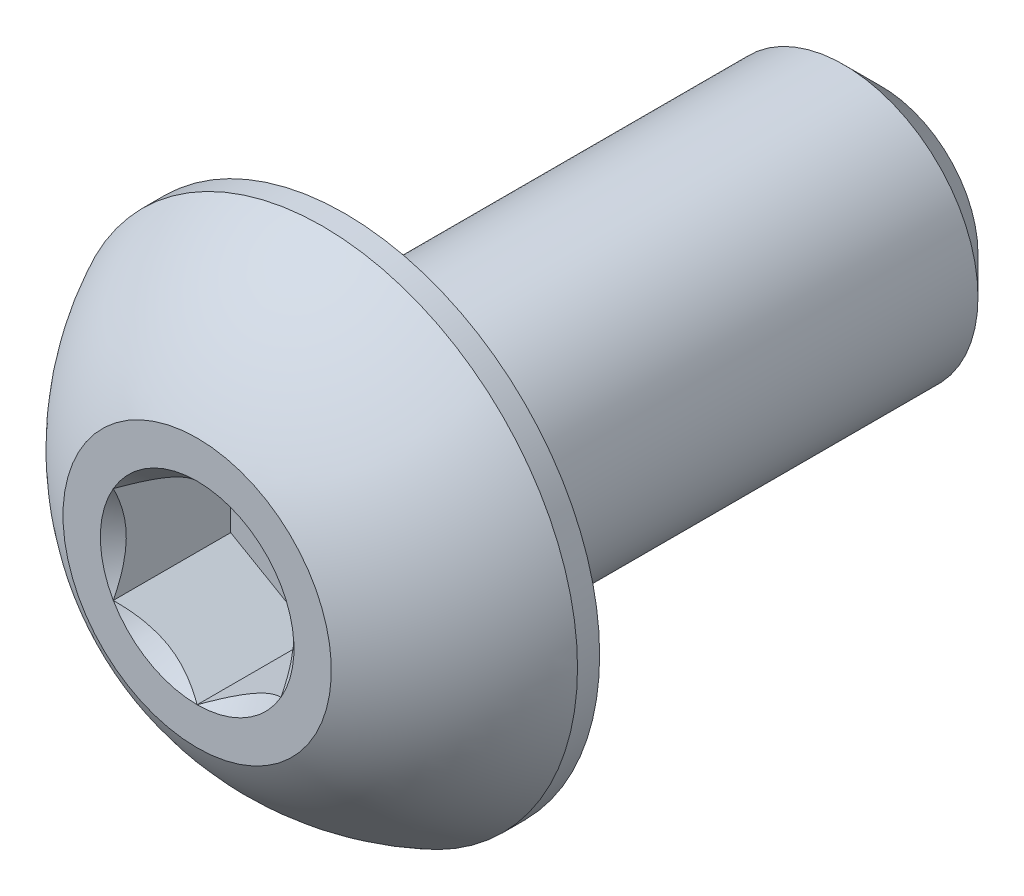
ISO-10303-21;
HEADER;
FILE_DESCRIPTION(('STEP AP214'),'2;1');
FILE_NAME('part.step','',(''),(''),'','','');
FILE_SCHEMA(('AUTOMOTIVE_DESIGN { 1 0 10303 214 1 1 1 1 }'));
ENDSEC;
DATA;
#1=APPLICATION_CONTEXT('core data for automotive mechanical design processes');
#2=APPLICATION_PROTOCOL_DEFINITION('international standard','automotive_design',2000,#1);
#3=PRODUCT_CONTEXT('',#1,'mechanical');
#4=PRODUCT('Part','Part','',(#3));
#5=PRODUCT_RELATED_PRODUCT_CATEGORY('part','',(#4));
#6=PRODUCT_DEFINITION_FORMATION('','',#4);
#7=PRODUCT_DEFINITION_CONTEXT('part definition',#1,'design');
#8=PRODUCT_DEFINITION('design','',#6,#7);
#9=PRODUCT_DEFINITION_SHAPE('','',#8);
#10=(LENGTH_UNIT() NAMED_UNIT(*) SI_UNIT(.MILLI.,.METRE.));
#11=(NAMED_UNIT(*) PLANE_ANGLE_UNIT() SI_UNIT($,.RADIAN.));
#12=(NAMED_UNIT(*) SI_UNIT($,.STERADIAN.) SOLID_ANGLE_UNIT());
#13=UNCERTAINTY_MEASURE_WITH_UNIT(LENGTH_MEASURE(1.E-05),#10,'distance_accuracy_value','');
#14=(GEOMETRIC_REPRESENTATION_CONTEXT(3) GLOBAL_UNCERTAINTY_ASSIGNED_CONTEXT((#13)) GLOBAL_UNIT_ASSIGNED_CONTEXT((#10,
#11,#12)) REPRESENTATION_CONTEXT('',''));
#15=CARTESIAN_POINT('',(0.,0.,0.));
#16=DIRECTION('',(0.,0.,1.));
#17=DIRECTION('',(1.,0.,0.));
#18=AXIS2_PLACEMENT_3D('',#15,#16,#17);
#19=CARTESIAN_POINT('',(0.,0.,5.1));
#20=DIRECTION('',(0.,0.,-1.));
#21=DIRECTION('',(-1.,0.,0.));
#22=AXIS2_PLACEMENT_3D('',#19,#20,#21);
#23=PLANE('',#22);
#24=CARTESIAN_POINT('',(0.,0.,5.1));
#25=DIRECTION('',(0.,0.,1.));
#26=DIRECTION('',(1.,0.,0.));
#27=AXIS2_PLACEMENT_3D('',#24,#25,#26);
#28=CIRCLE('',#27,1.44337567297406);
#29=CARTESIAN_POINT('',(-1.25,0.721687836487033,5.1));
#30=VERTEX_POINT('',#29);
#31=CARTESIAN_POINT('',(-1.25,-0.721687836487033,5.1));
#32=VERTEX_POINT('',#31);
#33=EDGE_CURVE('E132',#30,#32,#28,.T.);
#34=ORIENTED_EDGE('',*,*,#33,.F.);
#35=CARTESIAN_POINT('',(0.,1.44337567297406,5.1));
#36=VERTEX_POINT('',#35);
#37=EDGE_CURVE('E104',#36,#30,#28,.T.);
#38=ORIENTED_EDGE('',*,*,#37,.F.);
#39=CARTESIAN_POINT('',(1.25,0.721687836487032,5.1));
#40=VERTEX_POINT('',#39);
#41=EDGE_CURVE('E95',#40,#36,#28,.T.);
#42=ORIENTED_EDGE('',*,*,#41,.F.);
#43=CARTESIAN_POINT('',(1.25,-0.721687836487032,5.1));
#44=VERTEX_POINT('',#43);
#45=EDGE_CURVE('E56',#44,#40,#28,.T.);
#46=ORIENTED_EDGE('',*,*,#45,.F.);
#47=CARTESIAN_POINT('',(0.,-1.44337567297406,5.1));
#48=VERTEX_POINT('',#47);
#49=EDGE_CURVE('E63',#48,#44,#28,.T.);
#50=ORIENTED_EDGE('',*,*,#49,.F.);
#51=EDGE_CURVE('E133',#32,#48,#28,.T.);
#52=ORIENTED_EDGE('',*,*,#51,.F.);
#53=EDGE_LOOP('',(#34,#38,#42,#46,#50,#52));
#54=FACE_BOUND('',#53,.T.);
#55=CARTESIAN_POINT('',(0.,0.,5.1));
#56=DIRECTION('',(0.,0.,1.));
#57=DIRECTION('',(1.,0.,0.));
#58=AXIS2_PLACEMENT_3D('',#55,#56,#57);
#59=CIRCLE('',#58,2.);
#60=CARTESIAN_POINT('',(0.,2.,5.1));
#61=VERTEX_POINT('',#60);
#62=EDGE_CURVE('E50',#61,#61,#59,.T.);
#63=ORIENTED_EDGE('',*,*,#62,.T.);
#64=EDGE_LOOP('',(#63));
#65=FACE_BOUND('',#64,.T.);
#66=ADVANCED_FACE('F37',(#54,#65),#23,.F.);
#67=CARTESIAN_POINT('',(0.,0.,1.37355614973262));
#68=DIRECTION('',(0.,0.,1.));
#69=DIRECTION('',(0.,1.,0.));
#70=AXIS2_PLACEMENT_3D('',#67,#68,#69);
#71=SPHERICAL_SURFACE('',#70,4.22922968981298);
#72=CARTESIAN_POINT('',(0.,0.,3.23));
#73=DIRECTION('',(0.,0.,1.));
#74=DIRECTION('',(1.,0.,0.));
#75=AXIS2_PLACEMENT_3D('',#72,#73,#74);
#76=CIRCLE('',#75,3.8);
#77=CARTESIAN_POINT('',(0.,3.8,3.23));
#78=VERTEX_POINT('',#77);
#79=EDGE_CURVE('E215',#78,#78,#76,.T.);
#80=CARTESIAN_POINT('',(0.,2.,5.1));
#81=CARTESIAN_POINT('',(0.,2.02421343985614,5.08700457403551));
#82=CARTESIAN_POINT('',(0.,2.04830018323974,5.07377308703487));
#83=CARTESIAN_POINT('',(0.,2.09621120342126,5.04684315849425));
#84=CARTESIAN_POINT('',(0.,2.12003548021917,5.03314471695427));
#85=CARTESIAN_POINT('',(0.,2.16741249358867,5.00528604686797));
#86=CARTESIAN_POINT('',(0.,2.19096523016026,4.99112581832164));
#87=CARTESIAN_POINT('',(0.,2.23779021933682,4.96234896476404));
#88=CARTESIAN_POINT('',(0.,2.2610624719418,4.94773233975278));
#89=CARTESIAN_POINT('',(0.,2.30731764886072,4.91804824448586));
#90=CARTESIAN_POINT('',(0.,2.33030057317465,4.9029807742302));
#91=CARTESIAN_POINT('',(0.,2.37596836104235,4.87240071441713));
#92=CARTESIAN_POINT('',(0.,2.39865322459612,4.85688812485971));
#93=CARTESIAN_POINT('',(0.,2.44371627121513,4.82542372060412));
#94=CARTESIAN_POINT('',(0.,2.46609445428038,4.80947190590595));
#95=CARTESIAN_POINT('',(0.,2.51053563686181,4.77713511266833));
#96=CARTESIAN_POINT('',(0.,2.532598636378,4.76075013412888));
#97=CARTESIAN_POINT('',(0.,2.57640106852492,4.72755323903277));
#98=CARTESIAN_POINT('',(0.,2.59814050115564,4.71074132247611));
#99=CARTESIAN_POINT('',(0.,2.64128753915153,4.67669693941185));
#100=CARTESIAN_POINT('',(0.,2.66269514451671,4.65946447290426));
#101=CARTESIAN_POINT('',(0.,2.70517039368395,4.62458553779703));
#102=CARTESIAN_POINT('',(0.,2.72623803748602,4.6069390691974));
#103=CARTESIAN_POINT('',(0.,2.76802535840618,4.57123883507559));
#104=CARTESIAN_POINT('',(0.,2.78874503552428,4.55318506955341));
#105=CARTESIAN_POINT('',(0.,2.82982855017313,4.51667710151719));
#106=CARTESIAN_POINT('',(0.,2.85019238770389,4.49822289900316));
#107=CARTESIAN_POINT('',(0.,2.89055648548394,4.46092106906898));
#108=CARTESIAN_POINT('',(0.,2.91055674573324,4.44207344164884));
#109=CARTESIAN_POINT('',(0.,2.95018608940553,4.40399192347873));
#110=CARTESIAN_POINT('',(0.,2.96981517282852,4.38475803272878));
#111=CARTESIAN_POINT('',(0.,3.00869470434027,4.34591129624471));
#112=CARTESIAN_POINT('',(0.,3.02794515242903,4.3262984505106));
#113=CARTESIAN_POINT('',(0.,3.06606009863533,4.28670125639628));
#114=CARTESIAN_POINT('',(0.,3.08492459675287,4.26671690801607));
#115=CARTESIAN_POINT('',(0.,3.12226047503002,4.22638430210832));
#116=CARTESIAN_POINT('',(0.,3.14073185518965,4.20603604458079));
#117=CARTESIAN_POINT('',(0.,3.17727447893821,4.16498335215256));
#118=CARTESIAN_POINT('',(0.,3.19534572252715,4.14427891725186));
#119=CARTESIAN_POINT('',(0.,3.23108120656242,4.10252173718901));
#120=CARTESIAN_POINT('',(0.,3.24874544700875,4.08146899202686));
#121=CARTESIAN_POINT('',(0.,3.28366021283673,4.03902319090103));
#122=CARTESIAN_POINT('',(0.,3.30091073821838,4.01763013493736));
#123=CARTESIAN_POINT('',(0.,3.33499151919534,3.97451184097717));
#124=CARTESIAN_POINT('',(0.,3.35182177479064,3.95278660298064));
#125=CARTESIAN_POINT('',(0.,3.38505562116371,3.9090121999432));
#126=CARTESIAN_POINT('',(0.,3.40145921194149,3.88696303490229));
#127=CARTESIAN_POINT('',(0.,3.43383349577047,3.84254915584848));
#128=CARTESIAN_POINT('',(0.,3.44980418882166,3.8201844418356));
#129=CARTESIAN_POINT('',(0.,3.48130660877275,3.77514796280767));
#130=CARTESIAN_POINT('',(0.,3.49683833567264,3.75247619779264));
#131=CARTESIAN_POINT('',(0.,3.52745692170931,3.70683423141033));
#132=CARTESIAN_POINT('',(0.,3.5425437808461,3.68386403004306));
#133=CARTESIAN_POINT('',(0.,3.57226689871518,3.63763391896935));
#134=CARTESIAN_POINT('',(0.,3.58690315744748,3.61437400926291));
#135=CARTESIAN_POINT('',(0.,3.61571951333199,3.56757331973341));
#136=CARTESIAN_POINT('',(0.,3.62989961048422,3.54403253991033));
#137=CARTESIAN_POINT('',(0.,3.65779825442823,3.4966790546141));
#138=CARTESIAN_POINT('',(0.,3.67151680122002,3.47286634914094));
#139=CARTESIAN_POINT('',(0.,3.69848713452321,3.42497806212234));
#140=CARTESIAN_POINT('',(0.,3.71173892103461,3.4009024805769));
#141=CARTESIAN_POINT('',(0.,3.73777068821038,3.35249758420785));
#142=CARTESIAN_POINT('',(0.,3.75055066887474,3.32816826938425));
#143=CARTESIAN_POINT('',(0.,3.77563400658953,3.27926517055481));
#144=CARTESIAN_POINT('',(0.,3.78793736363997,3.25469138654897));
#145=CARTESIAN_POINT('',(0.,3.8,3.23));
#146=B_SPLINE_CURVE_WITH_KNOTS('',3,(#80,#81,#82,#83,#84,#85,#86,#87,#88,#89,#90,#91,#92,#93,
#94,#95,#96,#97,#98,#99,#100,#101,#102,#103,#104,#105,#106,#107,#108,#109,#110,#111,#112,#113,
#114,#115,#116,#117,#118,#119,#120,#121,#122,#123,#124,#125,#126,#127,#128,#129,#130,#131,#132,
#133,#134,#135,#136,#137,#138,#139,#140,#141,#142,#143,#144,#145),.UNSPECIFIED.,.F.,.F.,(4,2,2,
2,2,2,2,2,2,2,2,2,2,2,2,2,2,2,2,2,2,2,2,2,2,2,2,2,2,2,2,2,4),(0.,0.0824398589102646,
0.164879717820529,0.247319576730793,0.329759435641058,0.412199294551322,0.494639153461587,
0.57707901237185,0.659518871282115,0.741958730192379,0.824398589102644,0.906838448012908,
0.989278306923172,1.07171816583344,1.1541580247437,1.23659788365396,1.31903774256423,
1.40147760147449,1.48391746038476,1.56635731929502,1.64879717820529,1.73123703711555,
1.81367689602582,1.89611675493608,1.97855661384634,2.06099647275661,2.14343633166687,
2.22587619057714,2.3083160494874,2.39075590839767,2.47319576730793,2.55563562621819,
2.63807548512846),.UNSPECIFIED.);
#147=EDGE_CURVE('BSEAM220',#61,#78,#146,.T.);
#148=ORIENTED_EDGE('',*,*,#62,.F.);
#149=ORIENTED_EDGE('',*,*,#79,.T.);
#150=ORIENTED_EDGE('',*,*,#147,.T.);
#151=ORIENTED_EDGE('',*,*,#147,.F.);
#152=EDGE_LOOP('',(#148,#150,#149,#151));
#153=FACE_BOUND('',#152,.T.);
#154=ADVANCED_FACE('F220',(#153),#71,.T.);
#155=CARTESIAN_POINT('',(0.,0.,5.1));
#156=DIRECTION('',(0.,0.,1.));
#157=DIRECTION('',(1.,0.,0.));
#158=AXIS2_PLACEMENT_3D('',#155,#156,#157);
#159=CYLINDRICAL_SURFACE('',#158,3.8);
#160=ORIENTED_EDGE('',*,*,#79,.F.);
#161=EDGE_LOOP('',(#160));
#162=FACE_BOUND('',#161,.T.);
#163=CARTESIAN_POINT('',(0.,0.,2.9));
#164=DIRECTION('',(0.,0.,1.));
#165=DIRECTION('',(1.,0.,0.));
#166=AXIS2_PLACEMENT_3D('',#163,#164,#165);
#167=CIRCLE('',#166,3.8);
#168=CARTESIAN_POINT('',(3.8,0.,2.9));
#169=VERTEX_POINT('',#168);
#170=EDGE_CURVE('E212',#169,#169,#167,.T.);
#171=ORIENTED_EDGE('',*,*,#170,.T.);
#172=EDGE_LOOP('',(#171));
#173=FACE_BOUND('',#172,.T.);
#174=ADVANCED_FACE('F223',(#162,#173),#159,.T.);
#175=CARTESIAN_POINT('',(0.,2.,2.9));
#176=DIRECTION('',(0.,0.,1.));
#177=DIRECTION('',(1.,0.,0.));
#178=AXIS2_PLACEMENT_3D('',#175,#176,#177);
#179=PLANE('',#178);
#180=ORIENTED_EDGE('',*,*,#170,.F.);
#181=EDGE_LOOP('',(#180));
#182=FACE_BOUND('',#181,.T.);
#183=CARTESIAN_POINT('',(0.,0.,2.9));
#184=DIRECTION('',(0.,0.,1.));
#185=DIRECTION('',(1.,0.,0.));
#186=AXIS2_PLACEMENT_3D('',#183,#184,#185);
#187=CIRCLE('',#186,2.);
#188=CARTESIAN_POINT('',(2.,0.,2.9));
#189=VERTEX_POINT('',#188);
#190=EDGE_CURVE('E209',#189,#189,#187,.T.);
#191=ORIENTED_EDGE('',*,*,#190,.T.);
#192=EDGE_LOOP('',(#191));
#193=FACE_BOUND('',#192,.T.);
#194=ADVANCED_FACE('F228',(#182,#193),#179,.F.);
#195=CARTESIAN_POINT('',(0.,0.,5.1));
#196=DIRECTION('',(0.,0.,1.));
#197=DIRECTION('',(1.,0.,0.));
#198=AXIS2_PLACEMENT_3D('',#195,#196,#197);
#199=CYLINDRICAL_SURFACE('',#198,2.);
#200=ORIENTED_EDGE('',*,*,#190,.F.);
#201=EDGE_LOOP('',(#200));
#202=FACE_BOUND('',#201,.T.);
#203=CARTESIAN_POINT('',(0.,0.,-4.54));
#204=DIRECTION('',(0.,0.,1.));
#205=DIRECTION('',(1.,0.,0.));
#206=AXIS2_PLACEMENT_3D('',#203,#204,#205);
#207=CIRCLE('',#206,2.);
#208=CARTESIAN_POINT('',(2.,0.,-4.54));
#209=VERTEX_POINT('',#208);
#210=EDGE_CURVE('E206',#209,#209,#207,.T.);
#211=ORIENTED_EDGE('',*,*,#210,.T.);
#212=EDGE_LOOP('',(#211));
#213=FACE_BOUND('',#212,.T.);
#214=ADVANCED_FACE('F234',(#202,#213),#199,.T.);
#215=CARTESIAN_POINT('',(0.,0.,-5.1));
#216=DIRECTION('',(0.,0.,1.));
#217=DIRECTION('',(1.,0.,0.));
#218=AXIS2_PLACEMENT_3D('',#215,#216,#217);
#219=CONICAL_SURFACE('',#218,1.44,0.785398163397445);
#220=ORIENTED_EDGE('',*,*,#210,.F.);
#221=EDGE_LOOP('',(#220));
#222=FACE_BOUND('',#221,.T.);
#223=CARTESIAN_POINT('',(0.,0.,-5.1));
#224=DIRECTION('',(0.,0.,1.));
#225=DIRECTION('',(1.,0.,0.));
#226=AXIS2_PLACEMENT_3D('',#223,#224,#225);
#227=CIRCLE('',#226,1.44);
#228=CARTESIAN_POINT('',(1.44,0.,-5.1));
#229=VERTEX_POINT('',#228);
#230=EDGE_CURVE('E193',#229,#229,#227,.T.);
#231=ORIENTED_EDGE('',*,*,#230,.T.);
#232=EDGE_LOOP('',(#231));
#233=FACE_BOUND('',#232,.T.);
#234=ADVANCED_FACE('F240',(#222,#233),#219,.T.);
#235=CARTESIAN_POINT('',(0.,0.,-5.1));
#236=DIRECTION('',(0.,0.,1.));
#237=DIRECTION('',(1.,0.,0.));
#238=AXIS2_PLACEMENT_3D('',#235,#236,#237);
#239=PLANE('',#238);
#240=ORIENTED_EDGE('',*,*,#230,.F.);
#241=EDGE_LOOP('',(#240));
#242=FACE_BOUND('',#241,.T.);
#243=ADVANCED_FACE('F166',(#242),#239,.F.);
#244=CARTESIAN_POINT('',(0.,0.,5.1));
#245=DIRECTION('',(0.,0.,1.));
#246=DIRECTION('',(1.,0.,0.));
#247=AXIS2_PLACEMENT_3D('',#244,#245,#246);
#248=CONICAL_SURFACE('',#247,1.44337567297406,0.78539816339745);
#249=ORIENTED_EDGE('',*,*,#37,.T.);
#250=CARTESIAN_POINT('',(0.000199999999999987,1.4434911430279,5.10011548390914));
#251=CARTESIAN_POINT('',(-0.0427751670715869,1.41867941875065,5.0753216680551));
#252=CARTESIAN_POINT('',(-0.0864690047459484,1.39345276980743,5.05198373441868));
#253=CARTESIAN_POINT('',(-0.175565930841942,1.34201263554194,5.00925200408454));
#254=CARTESIAN_POINT('',(-0.220977498357064,1.31579425481276,4.98988199236041));
#255=CARTESIAN_POINT('',(-0.31254782093526,1.26292610442246,4.95670048341348));
#256=CARTESIAN_POINT('',(-0.358683240175886,1.23628980770471,4.94280555905266));
#257=CARTESIAN_POINT('',(-0.451970080407593,1.18243062538508,4.92139728216064));
#258=CARTESIAN_POINT('',(-0.49911864913638,1.15520938653761,4.91386794156679));
#259=CARTESIAN_POINT('',(-0.580373556887253,1.10829684367467,4.9070744980507));
#260=CARTESIAN_POINT('',(-0.614374876627941,1.08866617256958,4.90606855910435));
#261=CARTESIAN_POINT('',(-0.682317764432478,1.04943932800611,4.90776141491132));
#262=CARTESIAN_POINT('',(-0.716259317655658,1.02984316311599,4.91046102721554));
#263=CARTESIAN_POINT('',(-0.7838148564575,0.990839954603499,4.91940893031638));
#264=CARTESIAN_POINT('',(-0.817428507286775,0.971433104248771,4.92566052589971));
#265=CARTESIAN_POINT('',(-0.884094638217813,0.932943395609905,4.9413756814139));
#266=CARTESIAN_POINT('',(-0.917146871030296,0.913860680098301,4.95084062008746));
#267=CARTESIAN_POINT('',(-1.00179969160026,0.864986351354568,4.97893139068759));
#268=CARTESIAN_POINT('',(-1.05286649242964,0.835502920149076,4.9996701574522));
#269=CARTESIAN_POINT('',(-1.15300085411325,0.777690319475909,5.04638713467148));
#270=CARTESIAN_POINT('',(-1.20207431157827,0.749357745598417,5.07234829594677));
#271=CARTESIAN_POINT('',(-1.2502,0.721572366433195,5.10011548390914));
#272=B_SPLINE_CURVE_WITH_KNOTS('',3,(#250,#251,#252,#253,#254,#255,#256,#257,#258,#259,#260,
#261,#262,#263,#264,#265,#266,#267,#268,#269,#270,#271),.UNSPECIFIED.,.F.,.F.,(4,2,2,2,2,2,2,2,
2,2,4),(0.,0.166533409618304,0.334037607289762,0.498880396489699,0.663307919240275,
0.780963963458827,0.898645970148453,1.01643764860773,1.1342799317155,1.32148652032141,
1.50809158792573),.UNSPECIFIED.);
#273=EDGE_CURVE('E11',#36,#30,#272,.T.);
#274=ORIENTED_EDGE('',*,*,#273,.F.);
#275=EDGE_LOOP('',(#249,#274));
#276=FACE_BOUND('',#275,.T.);
#277=ADVANCED_FACE('F108',(#276),#248,.F.);
#278=ORIENTED_EDGE('',*,*,#33,.T.);
#279=CARTESIAN_POINT('',(-1.25,-1.43934010808077,5.56298209689233));
#280=CARTESIAN_POINT('',(-1.25,-1.40429313005659,5.53652492263289));
#281=CARTESIAN_POINT('',(-1.25,-1.36905087135599,5.51032716035428));
#282=CARTESIAN_POINT('',(-1.25,-1.29809650706311,5.45855757183958));
#283=CARTESIAN_POINT('',(-1.25,-1.26238428576495,5.43298590435629));
#284=CARTESIAN_POINT('',(-1.25,-1.15390111792708,5.35700599368946));
#285=CARTESIAN_POINT('',(-1.25,-1.08031646726264,5.30774028618957));
#286=CARTESIAN_POINT('',(-1.25,-0.926012322755095,5.21102583026313));
#287=CARTESIAN_POINT('',(-1.25,-0.845125318656146,5.1638412989418));
#288=CARTESIAN_POINT('',(-1.25,-0.679311174076602,5.07753073439041));
#289=CARTESIAN_POINT('',(-1.25,-0.594398891026687,5.0383775346269));
#290=CARTESIAN_POINT('',(-1.25,-0.46694481246074,4.99047722368829));
#291=CARTESIAN_POINT('',(-1.25,-0.426289985812821,4.97672948978634));
#292=CARTESIAN_POINT('',(-1.25,-0.343998850091267,4.95249792745054));
#293=CARTESIAN_POINT('',(-1.25,-0.302362473614962,4.94201432386977));
#294=CARTESIAN_POINT('',(-1.25,-0.219052696285665,4.9250301617483));
#295=CARTESIAN_POINT('',(-1.25,-0.1773934284745,4.91846136047137));
#296=CARTESIAN_POINT('',(-1.25,-0.0936293693401921,4.90943505345776));
#297=CARTESIAN_POINT('',(-1.25,-0.0515246558543961,4.90697684099727));
#298=CARTESIAN_POINT('',(-1.25,0.0311890576306314,4.90635406201329));
#299=CARTESIAN_POINT('',(-1.25,0.0717969625499302,4.90803711684625));
#300=CARTESIAN_POINT('',(-1.25,0.152668636885197,4.91526827059791));
#301=CARTESIAN_POINT('',(-1.25,0.192932338835358,4.92081711041311));
#302=CARTESIAN_POINT('',(-1.25,0.273499879165295,4.93557103646495));
#303=CARTESIAN_POINT('',(-1.25,0.313792180618511,4.94483817596411));
#304=CARTESIAN_POINT('',(-1.25,0.393496413911457,4.96653617845735));
#305=CARTESIAN_POINT('',(-1.25,0.432908419115059,4.97896677673064));
#306=CARTESIAN_POINT('',(-1.25,0.556992735862298,5.02277935293144));
#307=CARTESIAN_POINT('',(-1.25,0.639898924666085,5.05915107287596));
#308=CARTESIAN_POINT('',(-1.25,0.801816555499701,5.14001916217834));
#309=CARTESIAN_POINT('',(-1.25,0.880812666325044,5.18454472091199));
#310=CARTESIAN_POINT('',(-1.25,1.0317856127975,5.27640487666662));
#311=CARTESIAN_POINT('',(-1.25,1.10391618485086,5.32348993391625));
#312=CARTESIAN_POINT('',(-1.25,1.2101860604331,5.39627856159854));
#313=CARTESIAN_POINT('',(-1.25,1.24515069969379,5.42079808539336));
#314=CARTESIAN_POINT('',(-1.25,1.31460220852736,5.47048563676568));
#315=CARTESIAN_POINT('',(-1.25,1.34908920596618,5.49565348541552));
#316=CARTESIAN_POINT('',(-1.25,1.38337731682911,5.52109014884121));
#317=B_SPLINE_CURVE_WITH_KNOTS('',3,(#279,#280,#281,#282,#283,#284,#285,#286,#287,#288,#289,
#290,#291,#292,#293,#294,#295,#296,#297,#298,#299,#300,#301,#302,#303,#304,#305,#306,#307,#308,
#309,#310,#311,#312,#313,#314,#315,#316),.UNSPECIFIED.,.F.,.F.,(4,2,2,2,2,2,2,2,2,2,2,2,2,2,2,2,
2,2,4),(0.,0.131732960381448,0.263498984161645,0.529042014455825,0.809741926134618,
1.08947609717225,1.21811634272576,1.346765447839,1.47310084517844,1.59941451973784,
1.72115042167849,1.84290966131735,1.96679153905341,2.09066305366039,2.36146692896009,
2.63325989198491,2.89154668212279,3.01965734507713,3.14773302245628),.UNSPECIFIED.);
#318=EDGE_CURVE('E103',#30,#32,#317,.F.);
#319=ORIENTED_EDGE('',*,*,#318,.F.);
#320=EDGE_LOOP('',(#278,#319));
#321=FACE_BOUND('',#320,.T.);
#322=ADVANCED_FACE('F253',(#321),#248,.F.);
#323=ORIENTED_EDGE('',*,*,#51,.T.);
#324=CARTESIAN_POINT('',(-1.2502,-0.721572366433194,5.10011548390914));
#325=CARTESIAN_POINT('',(-1.20722483292841,-0.746384090710444,5.0753216680551));
#326=CARTESIAN_POINT('',(-1.16353099525405,-0.771610739653664,5.05198373441868));
#327=CARTESIAN_POINT('',(-1.07443406915806,-0.823050873919154,5.00925200408454));
#328=CARTESIAN_POINT('',(-1.02902250164294,-0.849269254648333,4.98988199236041));
#329=CARTESIAN_POINT('',(-0.937452179064741,-0.902137405038635,4.95670048341348));
#330=CARTESIAN_POINT('',(-0.891316759824115,-0.928773701756387,4.94280555905266));
#331=CARTESIAN_POINT('',(-0.798029919592409,-0.982632884076012,4.92139728216064));
#332=CARTESIAN_POINT('',(-0.750881350863621,-1.00985412292348,4.91386794156679));
#333=CARTESIAN_POINT('',(-0.669626443112749,-1.05676666578643,4.9070744980507));
#334=CARTESIAN_POINT('',(-0.63562512337206,-1.07639733689152,4.90606855910435));
#335=CARTESIAN_POINT('',(-0.567682235567524,-1.11562418145499,4.90776141491132));
#336=CARTESIAN_POINT('',(-0.533740682344344,-1.1352203463451,4.91046102721554));
#337=CARTESIAN_POINT('',(-0.466185143542502,-1.1742235548576,4.91940893031638));
#338=CARTESIAN_POINT('',(-0.432571492713226,-1.19363040521233,4.92566052589971));
#339=CARTESIAN_POINT('',(-0.365905361782188,-1.23212011385119,4.9413756814139));
#340=CARTESIAN_POINT('',(-0.332853128969706,-1.2512028293628,4.95084062008746));
#341=CARTESIAN_POINT('',(-0.248200308399737,-1.30007715810653,4.97893139068759));
#342=CARTESIAN_POINT('',(-0.197133507570363,-1.32956058931202,4.9996701574522));
#343=CARTESIAN_POINT('',(-0.0969991458867458,-1.38737318998519,5.04638713467148));
#344=CARTESIAN_POINT('',(-0.0479256884217311,-1.41570576386268,5.07234829594677));
#345=CARTESIAN_POINT('',(0.000199999999999486,-1.4434911430279,5.10011548390914));
#346=B_SPLINE_CURVE_WITH_KNOTS('',3,(#324,#325,#326,#327,#328,#329,#330,#331,#332,#333,#334,
#335,#336,#337,#338,#339,#340,#341,#342,#343,#344,#345),.UNSPECIFIED.,.F.,.F.,(4,2,2,2,2,2,2,2,
2,2,4),(0.,0.166533409618303,0.334037607289761,0.498880396489697,0.663307919240273,
0.780963963458825,0.898645970148451,1.01643764860773,1.13427993171549,1.32148652032141,
1.50809158792573),.UNSPECIFIED.);
#347=EDGE_CURVE('E142',#32,#48,#346,.T.);
#348=ORIENTED_EDGE('',*,*,#347,.F.);
#349=EDGE_LOOP('',(#323,#348));
#350=FACE_BOUND('',#349,.T.);
#351=ADVANCED_FACE('F270',(#350),#248,.F.);
#352=ORIENTED_EDGE('',*,*,#49,.T.);
#353=CARTESIAN_POINT('',(-0.000200000000000272,-1.4434911430279,5.10011548390914));
#354=CARTESIAN_POINT('',(0.0427751670715864,-1.41867941875065,5.0753216680551));
#355=CARTESIAN_POINT('',(0.0864690047459478,-1.39345276980743,5.05198373441868));
#356=CARTESIAN_POINT('',(0.175565930841942,-1.34201263554194,5.00925200408454));
#357=CARTESIAN_POINT('',(0.220977498357063,-1.31579425481276,4.98988199236041));
#358=CARTESIAN_POINT('',(0.312547820935259,-1.26292610442246,4.95670048341348));
#359=CARTESIAN_POINT('',(0.358683240175885,-1.23628980770471,4.94280555905266));
#360=CARTESIAN_POINT('',(0.451970080407592,-1.18243062538508,4.92139728216064));
#361=CARTESIAN_POINT('',(0.499118649136379,-1.15520938653761,4.91386794156679));
#362=CARTESIAN_POINT('',(0.580373556887252,-1.10829684367467,4.9070744980507));
#363=CARTESIAN_POINT('',(0.61437487662794,-1.08866617256958,4.90606855910435));
#364=CARTESIAN_POINT('',(0.682317764432477,-1.04943932800611,4.90776141491132));
#365=CARTESIAN_POINT('',(0.716259317655657,-1.02984316311599,4.91046102721554));
#366=CARTESIAN_POINT('',(0.783814856457499,-0.990839954603499,4.91940893031638));
#367=CARTESIAN_POINT('',(0.817428507286775,-0.971433104248771,4.92566052589971));
#368=CARTESIAN_POINT('',(0.884094638217813,-0.932943395609905,4.9413756814139));
#369=CARTESIAN_POINT('',(0.917146871030295,-0.9138606800983,4.95084062008746));
#370=CARTESIAN_POINT('',(1.00179969160026,-0.864986351354568,4.97893139068759));
#371=CARTESIAN_POINT('',(1.05286649242964,-0.835502920149076,4.9996701574522));
#372=CARTESIAN_POINT('',(1.15300085411325,-0.777690319475908,5.04638713467148));
#373=CARTESIAN_POINT('',(1.20207431157827,-0.749357745598417,5.07234829594677));
#374=CARTESIAN_POINT('',(1.2502,-0.721572366433194,5.10011548390914));
#375=B_SPLINE_CURVE_WITH_KNOTS('',3,(#353,#354,#355,#356,#357,#358,#359,#360,#361,#362,#363,
#364,#365,#366,#367,#368,#369,#370,#371,#372,#373,#374),.UNSPECIFIED.,.F.,.F.,(4,2,2,2,2,2,2,2,
2,2,4),(0.,0.166533409618304,0.334037607289761,0.498880396489698,0.663307919240274,
0.780963963458826,0.898645970148452,1.01643764860773,1.13427993171549,1.32148652032141,
1.50809158792574),.UNSPECIFIED.);
#376=EDGE_CURVE('E350',#48,#44,#375,.T.);
#377=ORIENTED_EDGE('',*,*,#376,.F.);
#378=EDGE_LOOP('',(#352,#377));
#379=FACE_BOUND('',#378,.T.);
#380=ADVANCED_FACE('F277',(#379),#248,.F.);
#381=ORIENTED_EDGE('',*,*,#45,.T.);
#382=CARTESIAN_POINT('',(1.25,-1.43934010808077,5.56298209689233));
#383=CARTESIAN_POINT('',(1.25,-1.40429313005659,5.53652492263289));
#384=CARTESIAN_POINT('',(1.25,-1.36905087135599,5.51032716035428));
#385=CARTESIAN_POINT('',(1.25,-1.29809650706311,5.45855757183958));
#386=CARTESIAN_POINT('',(1.25,-1.26238428576495,5.43298590435629));
#387=CARTESIAN_POINT('',(1.25,-1.15390111792708,5.35700599368946));
#388=CARTESIAN_POINT('',(1.25,-1.08031646726264,5.30774028618957));
#389=CARTESIAN_POINT('',(1.25,-0.926012322755096,5.21102583026313));
#390=CARTESIAN_POINT('',(1.25,-0.845125318656147,5.1638412989418));
#391=CARTESIAN_POINT('',(1.25,-0.679311174076602,5.07753073439041));
#392=CARTESIAN_POINT('',(1.25,-0.594398891026688,5.0383775346269));
#393=CARTESIAN_POINT('',(1.25,-0.46694481246074,4.99047722368829));
#394=CARTESIAN_POINT('',(1.25,-0.426289985812821,4.97672948978634));
#395=CARTESIAN_POINT('',(1.25,-0.343998850091267,4.95249792745054));
#396=CARTESIAN_POINT('',(1.25,-0.302362473614962,4.94201432386977));
#397=CARTESIAN_POINT('',(1.25,-0.219052696285665,4.9250301617483));
#398=CARTESIAN_POINT('',(1.25,-0.177393428474499,4.91846136047137));
#399=CARTESIAN_POINT('',(1.25,-0.0936293693401918,4.90943505345776));
#400=CARTESIAN_POINT('',(1.25,-0.0515246558543957,4.90697684099727));
#401=CARTESIAN_POINT('',(1.25,0.0311890576306319,4.90635406201329));
#402=CARTESIAN_POINT('',(1.25,0.0717969625499307,4.90803711684625));
#403=CARTESIAN_POINT('',(1.25,0.152668636885197,4.91526827059791));
#404=CARTESIAN_POINT('',(1.25,0.192932338835358,4.92081711041311));
#405=CARTESIAN_POINT('',(1.25,0.273499879165296,4.93557103646495));
#406=CARTESIAN_POINT('',(1.25,0.313792180618511,4.94483817596411));
#407=CARTESIAN_POINT('',(1.25,0.393496413911457,4.96653617845735));
#408=CARTESIAN_POINT('',(1.25,0.432908419115059,4.97896677673065));
#409=CARTESIAN_POINT('',(1.25,0.556992735862299,5.02277935293144));
#410=CARTESIAN_POINT('',(1.25,0.639898924666087,5.05915107287596));
#411=CARTESIAN_POINT('',(1.25,0.801816555499703,5.14001916217834));
#412=CARTESIAN_POINT('',(1.25,0.880812666325046,5.18454472091199));
#413=CARTESIAN_POINT('',(1.25,1.0317856127975,5.27640487666663));
#414=CARTESIAN_POINT('',(1.25,1.10391618485086,5.32348993391625));
#415=CARTESIAN_POINT('',(1.25,1.21018606043311,5.39627856159854));
#416=CARTESIAN_POINT('',(1.25,1.2451506996938,5.42079808539336));
#417=CARTESIAN_POINT('',(1.25,1.31460220852737,5.47048563676568));
#418=CARTESIAN_POINT('',(1.25,1.34908920596618,5.49565348541552));
#419=CARTESIAN_POINT('',(1.25,1.38337731682912,5.52109014884121));
#420=B_SPLINE_CURVE_WITH_KNOTS('',3,(#382,#383,#384,#385,#386,#387,#388,#389,#390,#391,#392,
#393,#394,#395,#396,#397,#398,#399,#400,#401,#402,#403,#404,#405,#406,#407,#408,#409,#410,#411,
#412,#413,#414,#415,#416,#417,#418,#419),.UNSPECIFIED.,.F.,.F.,(4,2,2,2,2,2,2,2,2,2,2,2,2,2,2,2,
2,2,4),(0.,0.131732960381448,0.263498984161645,0.529042014455825,0.809741926134618,
1.08947609717225,1.21811634272577,1.346765447839,1.47310084517844,1.59941451973784,
1.72115042167849,1.84290966131735,1.96679153905342,2.09066305366039,2.36146692896009,
2.63325989198491,2.89154668212279,3.01965734507713,3.14773302245628),.UNSPECIFIED.);
#421=EDGE_CURVE('E120',#44,#40,#420,.T.);
#422=ORIENTED_EDGE('',*,*,#421,.F.);
#423=EDGE_LOOP('',(#381,#422));
#424=FACE_BOUND('',#423,.T.);
#425=ADVANCED_FACE('F284',(#424),#248,.F.);
#426=ORIENTED_EDGE('',*,*,#41,.T.);
#427=CARTESIAN_POINT('',(1.2502,0.721572366433194,5.10011548390914));
#428=CARTESIAN_POINT('',(1.20722483292841,0.746384090710444,5.0753216680551));
#429=CARTESIAN_POINT('',(1.16353099525405,0.771610739653664,5.05198373441868));
#430=CARTESIAN_POINT('',(1.07443406915806,0.823050873919155,5.00925200408454));
#431=CARTESIAN_POINT('',(1.02902250164294,0.849269254648333,4.98988199236041));
#432=CARTESIAN_POINT('',(0.937452179064741,0.902137405038635,4.95670048341348));
#433=CARTESIAN_POINT('',(0.891316759824115,0.928773701756387,4.94280555905266));
#434=CARTESIAN_POINT('',(0.798029919592408,0.982632884076012,4.92139728216064));
#435=CARTESIAN_POINT('',(0.750881350863621,1.00985412292348,4.91386794156679));
#436=CARTESIAN_POINT('',(0.669626443112748,1.05676666578643,4.9070744980507));
#437=CARTESIAN_POINT('',(0.635625123372059,1.07639733689152,4.90606855910435));
#438=CARTESIAN_POINT('',(0.567682235567523,1.11562418145499,4.90776141491132));
#439=CARTESIAN_POINT('',(0.533740682344343,1.1352203463451,4.91046102721554));
#440=CARTESIAN_POINT('',(0.466185143542501,1.1742235548576,4.91940893031638));
#441=CARTESIAN_POINT('',(0.432571492713225,1.19363040521233,4.92566052589971));
#442=CARTESIAN_POINT('',(0.365905361782187,1.23212011385119,4.9413756814139));
#443=CARTESIAN_POINT('',(0.332853128969705,1.2512028293628,4.95084062008746));
#444=CARTESIAN_POINT('',(0.248200308399736,1.30007715810653,4.97893139068759));
#445=CARTESIAN_POINT('',(0.197133507570362,1.32956058931202,4.9996701574522));
#446=CARTESIAN_POINT('',(0.0969991458867455,1.38737318998519,5.04638713467148));
#447=CARTESIAN_POINT('',(0.0479256884217307,1.41570576386268,5.07234829594677));
#448=CARTESIAN_POINT('',(-0.000200000000000086,1.4434911430279,5.10011548390914));
#449=B_SPLINE_CURVE_WITH_KNOTS('',3,(#427,#428,#429,#430,#431,#432,#433,#434,#435,#436,#437,
#438,#439,#440,#441,#442,#443,#444,#445,#446,#447,#448),.UNSPECIFIED.,.F.,.F.,(4,2,2,2,2,2,2,2,
2,2,4),(0.,0.166533409618304,0.334037607289762,0.498880396489698,0.663307919240274,
0.780963963458827,0.898645970148453,1.01643764860773,1.13427993171549,1.32148652032141,
1.50809158792574),.UNSPECIFIED.);
#450=EDGE_CURVE('E99',#40,#36,#449,.T.);
#451=ORIENTED_EDGE('',*,*,#450,.F.);
#452=EDGE_LOOP('',(#426,#451));
#453=FACE_BOUND('',#452,.T.);
#454=ADVANCED_FACE('F97',(#453),#248,.F.);
#455=CARTESIAN_POINT('',(0.,0.,3.35));
#456=DIRECTION('',(0.,0.,1.));
#457=DIRECTION('',(1.,0.,0.));
#458=AXIS2_PLACEMENT_3D('',#455,#456,#457);
#459=PLANE('',#458);
#460=DIRECTION('',(-0.866025403784439,0.5,0.));
#461=VECTOR('',#460,1.);
#462=CARTESIAN_POINT('',(1.25,0.721687836487032,3.35));
#463=LINE('',#462,#461);
#464=CARTESIAN_POINT('',(1.25,0.721687836487032,3.35));
#465=VERTEX_POINT('',#464);
#466=CARTESIAN_POINT('',(0.,1.44337567297406,3.35));
#467=VERTEX_POINT('',#466);
#468=EDGE_CURVE('E119',#465,#467,#463,.T.);
#469=ORIENTED_EDGE('',*,*,#468,.T.);
#470=DIRECTION('',(-0.866025403784439,-0.5,0.));
#471=VECTOR('',#470,1.);
#472=CARTESIAN_POINT('',(0.,1.44337567297406,3.35));
#473=LINE('',#472,#471);
#474=CARTESIAN_POINT('',(-1.25,0.721687836487033,3.35));
#475=VERTEX_POINT('',#474);
#476=EDGE_CURVE('E124',#467,#475,#473,.T.);
#477=ORIENTED_EDGE('',*,*,#476,.T.);
#478=DIRECTION('',(0.,-1.,0.));
#479=VECTOR('',#478,1.);
#480=CARTESIAN_POINT('',(-1.25,0.721687836487033,3.35));
#481=LINE('',#480,#479);
#482=CARTESIAN_POINT('',(-1.25,-0.721687836487032,3.35));
#483=VERTEX_POINT('',#482);
#484=EDGE_CURVE('E181',#475,#483,#481,.T.);
#485=ORIENTED_EDGE('',*,*,#484,.T.);
#486=DIRECTION('',(0.866025403784439,-0.5,0.));
#487=VECTOR('',#486,1.);
#488=CARTESIAN_POINT('',(-1.25,-0.721687836487032,3.35));
#489=LINE('',#488,#487);
#490=CARTESIAN_POINT('',(0.,-1.44337567297406,3.35));
#491=VERTEX_POINT('',#490);
#492=EDGE_CURVE('E184',#483,#491,#489,.T.);
#493=ORIENTED_EDGE('',*,*,#492,.T.);
#494=DIRECTION('',(0.866025403784439,0.5,0.));
#495=VECTOR('',#494,1.);
#496=CARTESIAN_POINT('',(0.,-1.44337567297406,3.35));
#497=LINE('',#496,#495);
#498=CARTESIAN_POINT('',(1.25,-0.721687836487032,3.35));
#499=VERTEX_POINT('',#498);
#500=EDGE_CURVE('E187',#491,#499,#497,.T.);
#501=ORIENTED_EDGE('',*,*,#500,.T.);
#502=DIRECTION('',(0.,1.,0.));
#503=VECTOR('',#502,1.);
#504=CARTESIAN_POINT('',(1.25,-0.721687836487032,3.35));
#505=LINE('',#504,#503);
#506=EDGE_CURVE('E127',#499,#465,#505,.T.);
#507=ORIENTED_EDGE('',*,*,#506,.T.);
#508=EDGE_LOOP('',(#469,#477,#485,#493,#501,#507));
#509=FACE_BOUND('',#508,.T.);
#510=ADVANCED_FACE('F161',(#509),#459,.T.);
#511=CARTESIAN_POINT('',(0.,1.44337567297406,3.35));
#512=DIRECTION('',(-0.5,0.866025403784439,0.));
#513=DIRECTION('',(-0.866025403784439,-0.5,0.));
#514=AXIS2_PLACEMENT_3D('',#511,#512,#513);
#515=PLANE('',#514);
#516=DIRECTION('',(0.,0.,1.));
#517=VECTOR('',#516,1.);
#518=CARTESIAN_POINT('',(0.,1.44337567297406,3.35));
#519=LINE('',#518,#517);
#520=EDGE_CURVE('E116',#467,#36,#519,.T.);
#521=ORIENTED_EDGE('',*,*,#520,.T.);
#522=ORIENTED_EDGE('',*,*,#273,.T.);
#523=DIRECTION('',(0.,0.,1.));
#524=VECTOR('',#523,1.);
#525=CARTESIAN_POINT('',(-1.25,0.721687836487033,3.35));
#526=LINE('',#525,#524);
#527=EDGE_CURVE('E126',#475,#30,#526,.T.);
#528=ORIENTED_EDGE('',*,*,#527,.F.);
#529=ORIENTED_EDGE('',*,*,#476,.F.);
#530=EDGE_LOOP('',(#521,#522,#528,#529));
#531=FACE_BOUND('',#530,.T.);
#532=ADVANCED_FACE('F122',(#531),#515,.F.);
#533=CARTESIAN_POINT('',(-1.25,0.721687836487033,3.35));
#534=DIRECTION('',(-1.,0.,0.));
#535=DIRECTION('',(0.,0.,1.));
#536=AXIS2_PLACEMENT_3D('',#533,#534,#535);
#537=PLANE('',#536);
#538=ORIENTED_EDGE('',*,*,#527,.T.);
#539=ORIENTED_EDGE('',*,*,#318,.T.);
#540=DIRECTION('',(0.,0.,1.));
#541=VECTOR('',#540,1.);
#542=CARTESIAN_POINT('',(-1.25,-0.721687836487032,3.35));
#543=LINE('',#542,#541);
#544=EDGE_CURVE('E200',#483,#32,#543,.T.);
#545=ORIENTED_EDGE('',*,*,#544,.F.);
#546=ORIENTED_EDGE('',*,*,#484,.F.);
#547=EDGE_LOOP('',(#538,#539,#545,#546));
#548=FACE_BOUND('',#547,.T.);
#549=ADVANCED_FACE('F151',(#548),#537,.F.);
#550=CARTESIAN_POINT('',(-1.25,-0.721687836487032,3.35));
#551=DIRECTION('',(-0.5,-0.866025403784438,0.));
#552=DIRECTION('',(0.866025403784439,-0.5,0.));
#553=AXIS2_PLACEMENT_3D('',#550,#551,#552);
#554=PLANE('',#553);
#555=ORIENTED_EDGE('',*,*,#544,.T.);
#556=ORIENTED_EDGE('',*,*,#347,.T.);
#557=DIRECTION('',(0.,0.,1.));
#558=VECTOR('',#557,1.);
#559=CARTESIAN_POINT('',(0.,-1.44337567297406,3.35));
#560=LINE('',#559,#558);
#561=EDGE_CURVE('E197',#491,#48,#560,.T.);
#562=ORIENTED_EDGE('',*,*,#561,.F.);
#563=ORIENTED_EDGE('',*,*,#492,.F.);
#564=EDGE_LOOP('',(#555,#556,#562,#563));
#565=FACE_BOUND('',#564,.T.);
#566=ADVANCED_FACE('F154',(#565),#554,.F.);
#567=CARTESIAN_POINT('',(0.,-1.44337567297406,3.35));
#568=DIRECTION('',(0.5,-0.866025403784439,0.));
#569=DIRECTION('',(0.866025403784439,0.5,0.));
#570=AXIS2_PLACEMENT_3D('',#567,#568,#569);
#571=PLANE('',#570);
#572=ORIENTED_EDGE('',*,*,#561,.T.);
#573=ORIENTED_EDGE('',*,*,#376,.T.);
#574=DIRECTION('',(0.,0.,1.));
#575=VECTOR('',#574,1.);
#576=CARTESIAN_POINT('',(1.25,-0.721687836487032,3.35));
#577=LINE('',#576,#575);
#578=EDGE_CURVE('E194',#499,#44,#577,.T.);
#579=ORIENTED_EDGE('',*,*,#578,.F.);
#580=ORIENTED_EDGE('',*,*,#500,.F.);
#581=EDGE_LOOP('',(#572,#573,#579,#580));
#582=FACE_BOUND('',#581,.T.);
#583=ADVANCED_FACE('F308',(#582),#571,.F.);
#584=CARTESIAN_POINT('',(1.25,-0.721687836487032,3.35));
#585=DIRECTION('',(1.,0.,0.));
#586=DIRECTION('',(0.,1.,0.));
#587=AXIS2_PLACEMENT_3D('',#584,#585,#586);
#588=PLANE('',#587);
#589=ORIENTED_EDGE('',*,*,#578,.T.);
#590=ORIENTED_EDGE('',*,*,#421,.T.);
#591=DIRECTION('',(0.,0.,1.));
#592=VECTOR('',#591,1.);
#593=CARTESIAN_POINT('',(1.25,0.721687836487032,3.35));
#594=LINE('',#593,#592);
#595=EDGE_CURVE('E118',#465,#40,#594,.T.);
#596=ORIENTED_EDGE('',*,*,#595,.F.);
#597=ORIENTED_EDGE('',*,*,#506,.F.);
#598=EDGE_LOOP('',(#589,#590,#596,#597));
#599=FACE_BOUND('',#598,.T.);
#600=ADVANCED_FACE('F165',(#599),#588,.F.);
#601=CARTESIAN_POINT('',(1.25,0.721687836487032,3.35));
#602=DIRECTION('',(0.5,0.866025403784438,0.));
#603=DIRECTION('',(-0.866025403784439,0.5,0.));
#604=AXIS2_PLACEMENT_3D('',#601,#602,#603);
#605=PLANE('',#604);
#606=ORIENTED_EDGE('',*,*,#595,.T.);
#607=ORIENTED_EDGE('',*,*,#450,.T.);
#608=ORIENTED_EDGE('',*,*,#520,.F.);
#609=ORIENTED_EDGE('',*,*,#468,.F.);
#610=EDGE_LOOP('',(#606,#607,#608,#609));
#611=FACE_BOUND('',#610,.T.);
#612=ADVANCED_FACE('F114',(#611),#605,.F.);
#613=CLOSED_SHELL('',(#66,#154,#174,#194,#214,#234,#243,#277,#322,#351,#380,#425,#454,#510,#532,
#549,#566,#583,#600,#612));
#614=MANIFOLD_SOLID_BREP('B2',#613);
#615=ADVANCED_BREP_SHAPE_REPRESENTATION('',(#18,#614),#14);
#616=SHAPE_DEFINITION_REPRESENTATION(#9,#615);
ENDSEC;
END-ISO-10303-21;
